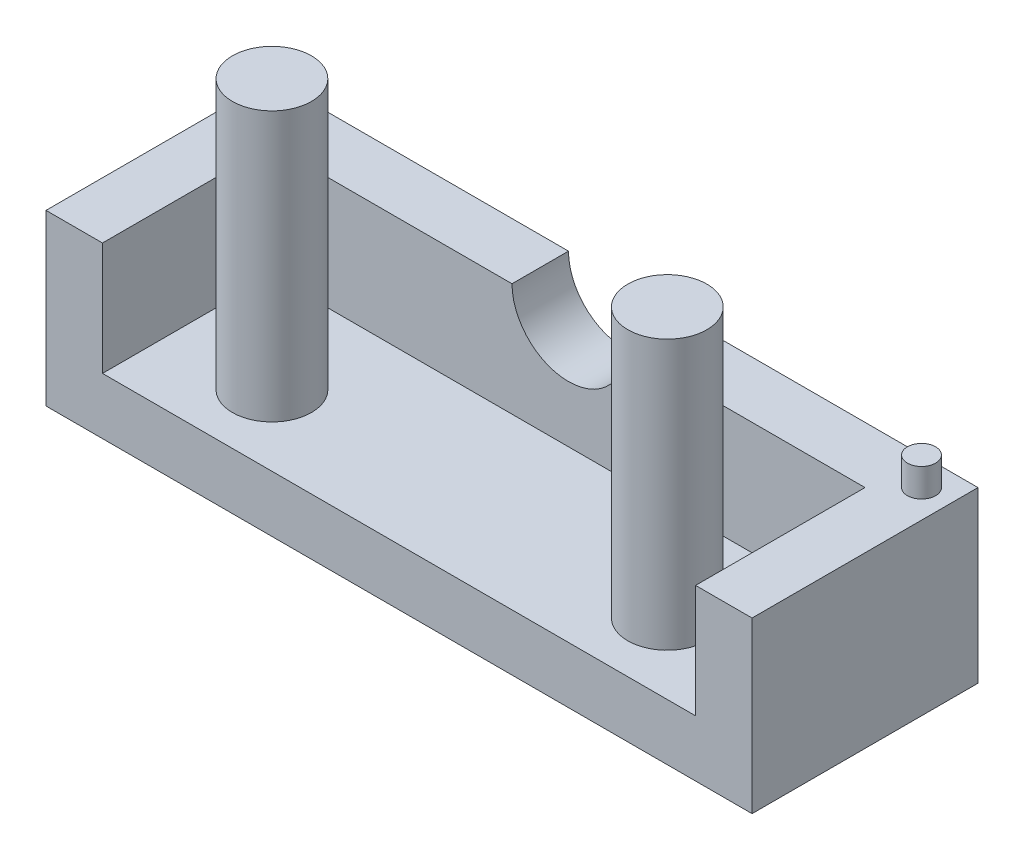
ISO-10303-21;
HEADER;
FILE_DESCRIPTION(('STEP AP214'),'2;1');
FILE_NAME('part.step','',(''),(''),'','','');
FILE_SCHEMA(('AUTOMOTIVE_DESIGN { 1 0 10303 214 1 1 1 1 }'));
ENDSEC;
DATA;
#1=APPLICATION_CONTEXT('core data for automotive mechanical design processes');
#2=APPLICATION_PROTOCOL_DEFINITION('international standard','automotive_design',2000,#1);
#3=PRODUCT_CONTEXT('',#1,'mechanical');
#4=PRODUCT('Part','Part','',(#3));
#5=PRODUCT_RELATED_PRODUCT_CATEGORY('part','',(#4));
#6=PRODUCT_DEFINITION_FORMATION('','',#4);
#7=PRODUCT_DEFINITION_CONTEXT('part definition',#1,'design');
#8=PRODUCT_DEFINITION('design','',#6,#7);
#9=PRODUCT_DEFINITION_SHAPE('','',#8);
#10=(LENGTH_UNIT() NAMED_UNIT(*) SI_UNIT(.MILLI.,.METRE.));
#11=(NAMED_UNIT(*) PLANE_ANGLE_UNIT() SI_UNIT($,.RADIAN.));
#12=(NAMED_UNIT(*) SI_UNIT($,.STERADIAN.) SOLID_ANGLE_UNIT());
#13=UNCERTAINTY_MEASURE_WITH_UNIT(LENGTH_MEASURE(1.E-05),#10,'distance_accuracy_value','');
#14=(GEOMETRIC_REPRESENTATION_CONTEXT(3) GLOBAL_UNCERTAINTY_ASSIGNED_CONTEXT((#13)) GLOBAL_UNIT_ASSIGNED_CONTEXT((#10,
#11,#12)) REPRESENTATION_CONTEXT('',''));
#15=CARTESIAN_POINT('',(0.,0.,0.));
#16=DIRECTION('',(0.,0.,1.));
#17=DIRECTION('',(1.,0.,0.));
#18=AXIS2_PLACEMENT_3D('',#15,#16,#17);
#19=CARTESIAN_POINT('',(-7.,3.04,-11.5));
#20=DIRECTION('',(0.,1.,0.));
#21=DIRECTION('',(0.,0.,1.));
#22=AXIS2_PLACEMENT_3D('',#19,#20,#21);
#23=CYLINDRICAL_SURFACE('',#22,1.4);
#24=CARTESIAN_POINT('',(-7.,3.04,-11.5));
#25=DIRECTION('',(0.,1.,0.));
#26=DIRECTION('',(0.,0.,1.));
#27=AXIS2_PLACEMENT_3D('',#24,#25,#26);
#28=CIRCLE('',#27,1.4);
#29=CARTESIAN_POINT('',(-7.,3.04,-10.1));
#30=VERTEX_POINT('',#29);
#31=EDGE_CURVE('E11',#30,#30,#28,.T.);
#32=ORIENTED_EDGE('',*,*,#31,.T.);
#33=EDGE_LOOP('',(#32));
#34=FACE_BOUND('',#33,.T.);
#35=CARTESIAN_POINT('',(-7.,12.58,-11.5));
#36=DIRECTION('',(0.,1.,0.));
#37=DIRECTION('',(0.,0.,1.));
#38=AXIS2_PLACEMENT_3D('',#35,#36,#37);
#39=CIRCLE('',#38,1.4);
#40=CARTESIAN_POINT('',(-7.,12.58,-10.1));
#41=VERTEX_POINT('',#40);
#42=EDGE_CURVE('E146',#41,#41,#39,.T.);
#43=ORIENTED_EDGE('',*,*,#42,.F.);
#44=EDGE_LOOP('',(#43));
#45=FACE_BOUND('',#44,.T.);
#46=ADVANCED_FACE('F45',(#34,#45),#23,.T.);
#47=CARTESIAN_POINT('',(7.,3.04,-11.5));
#48=DIRECTION('',(0.,1.,0.));
#49=DIRECTION('',(0.,0.,1.));
#50=AXIS2_PLACEMENT_3D('',#47,#48,#49);
#51=CYLINDRICAL_SURFACE('',#50,1.4);
#52=CARTESIAN_POINT('',(7.,3.04,-11.5));
#53=DIRECTION('',(0.,1.,0.));
#54=DIRECTION('',(0.,0.,1.));
#55=AXIS2_PLACEMENT_3D('',#52,#53,#54);
#56=CIRCLE('',#55,1.4);
#57=CARTESIAN_POINT('',(7.,3.04,-10.1));
#58=VERTEX_POINT('',#57);
#59=EDGE_CURVE('E172',#58,#58,#56,.T.);
#60=ORIENTED_EDGE('',*,*,#59,.T.);
#61=EDGE_LOOP('',(#60));
#62=FACE_BOUND('',#61,.T.);
#63=CARTESIAN_POINT('',(7.,12.58,-11.5));
#64=DIRECTION('',(0.,1.,0.));
#65=DIRECTION('',(0.,0.,1.));
#66=AXIS2_PLACEMENT_3D('',#63,#64,#65);
#67=CIRCLE('',#66,1.4);
#68=CARTESIAN_POINT('',(7.,12.58,-10.1));
#69=VERTEX_POINT('',#68);
#70=EDGE_CURVE('E258',#69,#69,#67,.T.);
#71=ORIENTED_EDGE('',*,*,#70,.F.);
#72=EDGE_LOOP('',(#71));
#73=FACE_BOUND('',#72,.T.);
#74=ADVANCED_FACE('F297',(#62,#73),#51,.T.);
#75=CARTESIAN_POINT('',(0.,3.04,0.));
#76=DIRECTION('',(0.,-1.,0.));
#77=DIRECTION('',(0.,0.,-1.));
#78=AXIS2_PLACEMENT_3D('',#75,#76,#77);
#79=PLANE('',#78);
#80=ORIENTED_EDGE('',*,*,#31,.F.);
#81=EDGE_LOOP('',(#80));
#82=FACE_BOUND('',#81,.T.);
#83=ORIENTED_EDGE('',*,*,#59,.F.);
#84=EDGE_LOOP('',(#83));
#85=FACE_BOUND('',#84,.T.);
#86=DIRECTION('',(0.,0.,-1.));
#87=VECTOR('',#86,1.);
#88=CARTESIAN_POINT('',(10.5,3.04,0.));
#89=LINE('',#88,#87);
#90=CARTESIAN_POINT('',(10.5,3.04,-9.));
#91=VERTEX_POINT('',#90);
#92=CARTESIAN_POINT('',(10.5,3.04,-15.));
#93=VERTEX_POINT('',#92);
#94=EDGE_CURVE('E160',#91,#93,#89,.T.);
#95=ORIENTED_EDGE('',*,*,#94,.T.);
#96=DIRECTION('',(1.,0.,0.));
#97=VECTOR('',#96,1.);
#98=CARTESIAN_POINT('',(0.,3.04,-15.));
#99=LINE('',#98,#97);
#100=CARTESIAN_POINT('',(-10.5,3.04,-15.));
#101=VERTEX_POINT('',#100);
#102=EDGE_CURVE('E224',#101,#93,#99,.T.);
#103=ORIENTED_EDGE('',*,*,#102,.F.);
#104=DIRECTION('',(0.,0.,1.));
#105=VECTOR('',#104,1.);
#106=CARTESIAN_POINT('',(-10.5,3.04,0.));
#107=LINE('',#106,#105);
#108=CARTESIAN_POINT('',(-10.5,3.04,-9.));
#109=VERTEX_POINT('',#108);
#110=EDGE_CURVE('E231',#101,#109,#107,.T.);
#111=ORIENTED_EDGE('',*,*,#110,.T.);
#112=DIRECTION('',(-1.,0.,0.));
#113=VECTOR('',#112,1.);
#114=CARTESIAN_POINT('',(-12.5,3.04,-9.));
#115=LINE('',#114,#113);
#116=EDGE_CURVE('E176',#91,#109,#115,.T.);
#117=ORIENTED_EDGE('',*,*,#116,.F.);
#118=EDGE_LOOP('',(#95,#103,#111,#117));
#119=FACE_BOUND('',#118,.T.);
#120=ADVANCED_FACE('F239',(#82,#85,#119),#79,.F.);
#121=CARTESIAN_POINT('',(-12.5,1.04,-9.));
#122=DIRECTION('',(1.,0.,0.));
#123=DIRECTION('',(0.,0.,-1.));
#124=AXIS2_PLACEMENT_3D('',#121,#122,#123);
#125=PLANE('',#124);
#126=DIRECTION('',(0.,1.,0.));
#127=VECTOR('',#126,1.);
#128=CARTESIAN_POINT('',(-12.5,1.04,-9.));
#129=LINE('',#128,#127);
#130=CARTESIAN_POINT('',(-12.5,1.04,-9.));
#131=VERTEX_POINT('',#130);
#132=CARTESIAN_POINT('',(-12.5,7.04,-9.));
#133=VERTEX_POINT('',#132);
#134=EDGE_CURVE('E188',#131,#133,#129,.T.);
#135=ORIENTED_EDGE('',*,*,#134,.T.);
#136=DIRECTION('',(0.,0.,1.));
#137=VECTOR('',#136,1.);
#138=CARTESIAN_POINT('',(-12.5,7.04,-17.));
#139=LINE('',#138,#137);
#140=CARTESIAN_POINT('',(-12.5,7.04,-17.));
#141=VERTEX_POINT('',#140);
#142=EDGE_CURVE('E153',#141,#133,#139,.T.);
#143=ORIENTED_EDGE('',*,*,#142,.F.);
#144=DIRECTION('',(0.,1.,0.));
#145=VECTOR('',#144,1.);
#146=CARTESIAN_POINT('',(-12.5,1.04,-17.));
#147=LINE('',#146,#145);
#148=CARTESIAN_POINT('',(-12.5,1.04,-17.));
#149=VERTEX_POINT('',#148);
#150=EDGE_CURVE('E53',#149,#141,#147,.T.);
#151=ORIENTED_EDGE('',*,*,#150,.F.);
#152=DIRECTION('',(0.,0.,-1.));
#153=VECTOR('',#152,1.);
#154=CARTESIAN_POINT('',(-12.5,1.04,-9.));
#155=LINE('',#154,#153);
#156=EDGE_CURVE('E177',#131,#149,#155,.T.);
#157=ORIENTED_EDGE('',*,*,#156,.F.);
#158=EDGE_LOOP('',(#135,#143,#151,#157));
#159=FACE_BOUND('',#158,.T.);
#160=ADVANCED_FACE('F207',(#159),#125,.F.);
#161=CARTESIAN_POINT('',(-12.5,1.04,-17.));
#162=DIRECTION('',(0.,0.,1.));
#163=DIRECTION('',(1.,0.,0.));
#164=AXIS2_PLACEMENT_3D('',#161,#162,#163);
#165=PLANE('',#164);
#166=ORIENTED_EDGE('',*,*,#150,.T.);
#167=DIRECTION('',(-1.,0.,0.));
#168=VECTOR('',#167,1.);
#169=CARTESIAN_POINT('',(12.5,7.04,-17.));
#170=LINE('',#169,#168);
#171=CARTESIAN_POINT('',(-2.,7.04,-17.));
#172=VERTEX_POINT('',#171);
#173=EDGE_CURVE('E144',#172,#141,#170,.T.);
#174=ORIENTED_EDGE('',*,*,#173,.F.);
#175=CARTESIAN_POINT('',(0.,7.04,-17.));
#176=DIRECTION('',(0.,0.,1.));
#177=DIRECTION('',(1.,0.,0.));
#178=AXIS2_PLACEMENT_3D('',#175,#176,#177);
#179=CIRCLE('',#178,2.);
#180=CARTESIAN_POINT('',(2.,7.04,-17.));
#181=VERTEX_POINT('',#180);
#182=EDGE_CURVE('E125',#172,#181,#179,.T.);
#183=ORIENTED_EDGE('',*,*,#182,.T.);
#184=CARTESIAN_POINT('',(12.5,7.04,-17.));
#185=VERTEX_POINT('',#184);
#186=EDGE_CURVE('E141',#185,#181,#170,.T.);
#187=ORIENTED_EDGE('',*,*,#186,.F.);
#188=DIRECTION('',(0.,1.,0.));
#189=VECTOR('',#188,1.);
#190=CARTESIAN_POINT('',(12.5,1.04,-17.));
#191=LINE('',#190,#189);
#192=CARTESIAN_POINT('',(12.5,1.04,-17.));
#193=VERTEX_POINT('',#192);
#194=EDGE_CURVE('E197',#193,#185,#191,.T.);
#195=ORIENTED_EDGE('',*,*,#194,.F.);
#196=DIRECTION('',(1.,0.,0.));
#197=VECTOR('',#196,1.);
#198=CARTESIAN_POINT('',(-12.5,1.04,-17.));
#199=LINE('',#198,#197);
#200=EDGE_CURVE('E180',#149,#193,#199,.T.);
#201=ORIENTED_EDGE('',*,*,#200,.F.);
#202=EDGE_LOOP('',(#166,#174,#183,#187,#195,#201));
#203=FACE_BOUND('',#202,.T.);
#204=ADVANCED_FACE('F139',(#203),#165,.F.);
#205=CARTESIAN_POINT('',(12.5,1.04,-9.));
#206=DIRECTION('',(-1.,0.,0.));
#207=DIRECTION('',(0.,0.,1.));
#208=AXIS2_PLACEMENT_3D('',#205,#206,#207);
#209=PLANE('',#208);
#210=ORIENTED_EDGE('',*,*,#194,.T.);
#211=DIRECTION('',(0.,0.,-1.));
#212=VECTOR('',#211,1.);
#213=CARTESIAN_POINT('',(12.5,7.04,-9.));
#214=LINE('',#213,#212);
#215=CARTESIAN_POINT('',(12.5,7.04,-9.));
#216=VERTEX_POINT('',#215);
#217=EDGE_CURVE('E151',#216,#185,#214,.T.);
#218=ORIENTED_EDGE('',*,*,#217,.F.);
#219=DIRECTION('',(0.,1.,0.));
#220=VECTOR('',#219,1.);
#221=CARTESIAN_POINT('',(12.5,1.04,-9.));
#222=LINE('',#221,#220);
#223=CARTESIAN_POINT('',(12.5,1.04,-9.));
#224=VERTEX_POINT('',#223);
#225=EDGE_CURVE('E194',#224,#216,#222,.T.);
#226=ORIENTED_EDGE('',*,*,#225,.F.);
#227=DIRECTION('',(0.,0.,1.));
#228=VECTOR('',#227,1.);
#229=CARTESIAN_POINT('',(12.5,1.04,-9.));
#230=LINE('',#229,#228);
#231=EDGE_CURVE('E183',#193,#224,#230,.T.);
#232=ORIENTED_EDGE('',*,*,#231,.F.);
#233=EDGE_LOOP('',(#210,#218,#226,#232));
#234=FACE_BOUND('',#233,.T.);
#235=ADVANCED_FACE('F465',(#234),#209,.F.);
#236=CARTESIAN_POINT('',(-12.5,1.04,-9.));
#237=DIRECTION('',(0.,0.,-1.));
#238=DIRECTION('',(-1.,0.,0.));
#239=AXIS2_PLACEMENT_3D('',#236,#237,#238);
#240=PLANE('',#239);
#241=ORIENTED_EDGE('',*,*,#225,.T.);
#242=DIRECTION('',(1.,0.,0.));
#243=VECTOR('',#242,1.);
#244=CARTESIAN_POINT('',(-12.5,7.04,-9.));
#245=LINE('',#244,#243);
#246=CARTESIAN_POINT('',(10.5,7.04,-9.));
#247=VERTEX_POINT('',#246);
#248=EDGE_CURVE('E158',#247,#216,#245,.T.);
#249=ORIENTED_EDGE('',*,*,#248,.F.);
#250=DIRECTION('',(0.,1.,0.));
#251=VECTOR('',#250,1.);
#252=CARTESIAN_POINT('',(10.5,2.,-9.));
#253=LINE('',#252,#251);
#254=EDGE_CURVE('E244',#91,#247,#253,.T.);
#255=ORIENTED_EDGE('',*,*,#254,.F.);
#256=ORIENTED_EDGE('',*,*,#116,.T.);
#257=DIRECTION('',(0.,-1.,0.));
#258=VECTOR('',#257,1.);
#259=CARTESIAN_POINT('',(-10.5,7.04,-9.));
#260=LINE('',#259,#258);
#261=CARTESIAN_POINT('',(-10.5,7.04,-9.));
#262=VERTEX_POINT('',#261);
#263=EDGE_CURVE('E212',#262,#109,#260,.T.);
#264=ORIENTED_EDGE('',*,*,#263,.F.);
#265=EDGE_CURVE('E164',#133,#262,#245,.T.);
#266=ORIENTED_EDGE('',*,*,#265,.F.);
#267=ORIENTED_EDGE('',*,*,#134,.F.);
#268=DIRECTION('',(-1.,0.,0.));
#269=VECTOR('',#268,1.);
#270=CARTESIAN_POINT('',(-12.5,1.04,-9.));
#271=LINE('',#270,#269);
#272=EDGE_CURVE('E68',#224,#131,#271,.T.);
#273=ORIENTED_EDGE('',*,*,#272,.F.);
#274=EDGE_LOOP('',(#241,#249,#255,#256,#264,#266,#267,#273));
#275=FACE_BOUND('',#274,.T.);
#276=ADVANCED_FACE('F211',(#275),#240,.F.);
#277=CARTESIAN_POINT('',(0.,1.04,0.));
#278=DIRECTION('',(0.,-1.,0.));
#279=DIRECTION('',(0.,0.,-1.));
#280=AXIS2_PLACEMENT_3D('',#277,#278,#279);
#281=PLANE('',#280);
#282=ORIENTED_EDGE('',*,*,#156,.T.);
#283=ORIENTED_EDGE('',*,*,#200,.T.);
#284=ORIENTED_EDGE('',*,*,#231,.T.);
#285=ORIENTED_EDGE('',*,*,#272,.T.);
#286=EDGE_LOOP('',(#282,#283,#284,#285));
#287=FACE_BOUND('',#286,.T.);
#288=ADVANCED_FACE('F285',(#287),#281,.T.);
#289=CARTESIAN_POINT('',(0.,7.04,0.));
#290=DIRECTION('',(0.,1.,0.));
#291=DIRECTION('',(0.,0.,1.));
#292=AXIS2_PLACEMENT_3D('',#289,#290,#291);
#293=PLANE('',#292);
#294=CARTESIAN_POINT('',(-11.5,7.04,-16.));
#295=DIRECTION('',(0.,1.,0.));
#296=DIRECTION('',(0.,0.,1.));
#297=AXIS2_PLACEMENT_3D('',#294,#295,#296);
#298=CIRCLE('',#297,0.500000000000001);
#299=CARTESIAN_POINT('',(-11.5,7.04,-15.5));
#300=VERTEX_POINT('',#299);
#301=EDGE_CURVE('E270',#300,#300,#298,.T.);
#302=ORIENTED_EDGE('',*,*,#301,.F.);
#303=EDGE_LOOP('',(#302));
#304=FACE_BOUND('',#303,.T.);
#305=DIRECTION('',(0.,0.,1.));
#306=VECTOR('',#305,1.);
#307=CARTESIAN_POINT('',(-2.,7.04,-15.));
#308=LINE('',#307,#306);
#309=CARTESIAN_POINT('',(-2.,7.04,-15.));
#310=VERTEX_POINT('',#309);
#311=EDGE_CURVE('E134',#172,#310,#308,.T.);
#312=ORIENTED_EDGE('',*,*,#311,.F.);
#313=ORIENTED_EDGE('',*,*,#173,.T.);
#314=ORIENTED_EDGE('',*,*,#142,.T.);
#315=ORIENTED_EDGE('',*,*,#265,.T.);
#316=DIRECTION('',(0.,0.,1.));
#317=VECTOR('',#316,1.);
#318=CARTESIAN_POINT('',(-10.5,7.04,-15.));
#319=LINE('',#318,#317);
#320=CARTESIAN_POINT('',(-10.5,7.04,-15.));
#321=VERTEX_POINT('',#320);
#322=EDGE_CURVE('E214',#321,#262,#319,.T.);
#323=ORIENTED_EDGE('',*,*,#322,.F.);
#324=DIRECTION('',(-1.,0.,0.));
#325=VECTOR('',#324,1.);
#326=CARTESIAN_POINT('',(10.5,7.04,-15.));
#327=LINE('',#326,#325);
#328=EDGE_CURVE('E215',#310,#321,#327,.T.);
#329=ORIENTED_EDGE('',*,*,#328,.F.);
#330=EDGE_LOOP('',(#312,#313,#314,#315,#323,#329));
#331=FACE_BOUND('',#330,.T.);
#332=ADVANCED_FACE('F205',(#304,#331),#293,.T.);
#333=CARTESIAN_POINT('',(11.5,7.04,-16.));
#334=DIRECTION('',(0.,1.,0.));
#335=DIRECTION('',(0.,0.,1.));
#336=AXIS2_PLACEMENT_3D('',#333,#334,#335);
#337=CIRCLE('',#336,0.500000000000001);
#338=CARTESIAN_POINT('',(11.5,7.04,-15.5));
#339=VERTEX_POINT('',#338);
#340=EDGE_CURVE('E266',#339,#339,#337,.T.);
#341=ORIENTED_EDGE('',*,*,#340,.F.);
#342=EDGE_LOOP('',(#341));
#343=FACE_BOUND('',#342,.T.);
#344=DIRECTION('',(0.,0.,1.));
#345=VECTOR('',#344,1.);
#346=CARTESIAN_POINT('',(2.,7.04,-15.));
#347=LINE('',#346,#345);
#348=CARTESIAN_POINT('',(2.,7.04,-15.));
#349=VERTEX_POINT('',#348);
#350=EDGE_CURVE('E122',#349,#181,#347,.F.);
#351=ORIENTED_EDGE('',*,*,#350,.F.);
#352=CARTESIAN_POINT('',(10.5,7.04,-15.));
#353=VERTEX_POINT('',#352);
#354=EDGE_CURVE('E249',#353,#349,#327,.T.);
#355=ORIENTED_EDGE('',*,*,#354,.F.);
#356=DIRECTION('',(0.,0.,1.));
#357=VECTOR('',#356,1.);
#358=CARTESIAN_POINT('',(10.5,7.04,-15.));
#359=LINE('',#358,#357);
#360=EDGE_CURVE('E218',#353,#247,#359,.T.);
#361=ORIENTED_EDGE('',*,*,#360,.T.);
#362=ORIENTED_EDGE('',*,*,#248,.T.);
#363=ORIENTED_EDGE('',*,*,#217,.T.);
#364=ORIENTED_EDGE('',*,*,#186,.T.);
#365=EDGE_LOOP('',(#351,#355,#361,#362,#363,#364));
#366=FACE_BOUND('',#365,.T.);
#367=ADVANCED_FACE('F148',(#343,#366),#293,.T.);
#368=CARTESIAN_POINT('',(10.5,2.,-15.));
#369=DIRECTION('',(1.,0.,0.));
#370=DIRECTION('',(0.,0.,-1.));
#371=AXIS2_PLACEMENT_3D('',#368,#369,#370);
#372=PLANE('',#371);
#373=ORIENTED_EDGE('',*,*,#254,.T.);
#374=ORIENTED_EDGE('',*,*,#360,.F.);
#375=DIRECTION('',(0.,1.,0.));
#376=VECTOR('',#375,1.);
#377=CARTESIAN_POINT('',(10.5,2.,-15.));
#378=LINE('',#377,#376);
#379=EDGE_CURVE('E219',#93,#353,#378,.T.);
#380=ORIENTED_EDGE('',*,*,#379,.F.);
#381=ORIENTED_EDGE('',*,*,#94,.F.);
#382=EDGE_LOOP('',(#373,#374,#380,#381));
#383=FACE_BOUND('',#382,.T.);
#384=ADVANCED_FACE('F243',(#383),#372,.F.);
#385=CARTESIAN_POINT('',(-10.5,7.04,-15.));
#386=DIRECTION('',(-1.,0.,0.));
#387=DIRECTION('',(0.,0.,1.));
#388=AXIS2_PLACEMENT_3D('',#385,#386,#387);
#389=PLANE('',#388);
#390=DIRECTION('',(0.,-1.,0.));
#391=VECTOR('',#390,1.);
#392=CARTESIAN_POINT('',(-10.5,7.04,-15.));
#393=LINE('',#392,#391);
#394=EDGE_CURVE('E60',#321,#101,#393,.T.);
#395=ORIENTED_EDGE('',*,*,#394,.F.);
#396=ORIENTED_EDGE('',*,*,#322,.T.);
#397=ORIENTED_EDGE('',*,*,#263,.T.);
#398=ORIENTED_EDGE('',*,*,#110,.F.);
#399=EDGE_LOOP('',(#395,#396,#397,#398));
#400=FACE_BOUND('',#399,.T.);
#401=ADVANCED_FACE('F328',(#400),#389,.F.);
#402=CARTESIAN_POINT('',(0.,0.,-15.));
#403=DIRECTION('',(0.,0.,1.));
#404=DIRECTION('',(1.,0.,0.));
#405=AXIS2_PLACEMENT_3D('',#402,#403,#404);
#406=PLANE('',#405);
#407=CARTESIAN_POINT('',(0.,7.04,-15.));
#408=DIRECTION('',(0.,0.,1.));
#409=DIRECTION('',(1.,0.,0.));
#410=AXIS2_PLACEMENT_3D('',#407,#408,#409);
#411=CIRCLE('',#410,2.);
#412=EDGE_CURVE('E128',#310,#349,#411,.T.);
#413=ORIENTED_EDGE('',*,*,#412,.F.);
#414=ORIENTED_EDGE('',*,*,#328,.T.);
#415=ORIENTED_EDGE('',*,*,#394,.T.);
#416=ORIENTED_EDGE('',*,*,#102,.T.);
#417=ORIENTED_EDGE('',*,*,#379,.T.);
#418=ORIENTED_EDGE('',*,*,#354,.T.);
#419=EDGE_LOOP('',(#413,#414,#415,#416,#417,#418));
#420=FACE_BOUND('',#419,.T.);
#421=ADVANCED_FACE('F325',(#420),#406,.T.);
#422=CARTESIAN_POINT('',(0.,7.04,-15.));
#423=DIRECTION('',(0.,0.,1.));
#424=DIRECTION('',(1.,0.,0.));
#425=AXIS2_PLACEMENT_3D('',#422,#423,#424);
#426=CYLINDRICAL_SURFACE('',#425,2.);
#427=ORIENTED_EDGE('',*,*,#311,.T.);
#428=ORIENTED_EDGE('',*,*,#412,.T.);
#429=ORIENTED_EDGE('',*,*,#350,.T.);
#430=ORIENTED_EDGE('',*,*,#182,.F.);
#431=EDGE_LOOP('',(#427,#428,#429,#430));
#432=FACE_BOUND('',#431,.T.);
#433=ADVANCED_FACE('F124',(#432),#426,.F.);
#434=CARTESIAN_POINT('',(7.,12.58,-11.5));
#435=DIRECTION('',(0.,1.,0.));
#436=DIRECTION('',(0.,0.,1.));
#437=AXIS2_PLACEMENT_3D('',#434,#435,#436);
#438=PLANE('',#437);
#439=ORIENTED_EDGE('',*,*,#70,.T.);
#440=EDGE_LOOP('',(#439));
#441=FACE_BOUND('',#440,.T.);
#442=ADVANCED_FACE('F311',(#441),#438,.T.);
#443=CARTESIAN_POINT('',(-7.,12.58,-11.5));
#444=DIRECTION('',(0.,1.,0.));
#445=DIRECTION('',(0.,0.,1.));
#446=AXIS2_PLACEMENT_3D('',#443,#444,#445);
#447=PLANE('',#446);
#448=ORIENTED_EDGE('',*,*,#42,.T.);
#449=EDGE_LOOP('',(#448));
#450=FACE_BOUND('',#449,.T.);
#451=ADVANCED_FACE('F308',(#450),#447,.T.);
#452=CARTESIAN_POINT('',(11.5,8.04,-16.));
#453=DIRECTION('',(0.,-1.,0.));
#454=DIRECTION('',(0.,0.,-1.));
#455=AXIS2_PLACEMENT_3D('',#452,#453,#454);
#456=CYLINDRICAL_SURFACE('',#455,0.500000000000001);
#457=CARTESIAN_POINT('',(11.5,8.04,-16.));
#458=DIRECTION('',(0.,1.,0.));
#459=DIRECTION('',(0.,0.,1.));
#460=AXIS2_PLACEMENT_3D('',#457,#458,#459);
#461=CIRCLE('',#460,0.500000000000001);
#462=CARTESIAN_POINT('',(11.5,8.04,-15.5));
#463=VERTEX_POINT('',#462);
#464=EDGE_CURVE('E262',#463,#463,#461,.T.);
#465=ORIENTED_EDGE('',*,*,#464,.F.);
#466=EDGE_LOOP('',(#465));
#467=FACE_BOUND('',#466,.T.);
#468=ORIENTED_EDGE('',*,*,#340,.T.);
#469=EDGE_LOOP('',(#468));
#470=FACE_BOUND('',#469,.T.);
#471=ADVANCED_FACE('F310',(#467,#470),#456,.T.);
#472=CARTESIAN_POINT('',(11.5,8.04,-16.));
#473=DIRECTION('',(0.,1.,0.));
#474=DIRECTION('',(0.,0.,1.));
#475=AXIS2_PLACEMENT_3D('',#472,#473,#474);
#476=PLANE('',#475);
#477=ORIENTED_EDGE('',*,*,#464,.T.);
#478=EDGE_LOOP('',(#477));
#479=FACE_BOUND('',#478,.T.);
#480=ADVANCED_FACE('F317',(#479),#476,.T.);
#481=CARTESIAN_POINT('',(-11.5,8.04,-16.));
#482=DIRECTION('',(0.,-1.,0.));
#483=DIRECTION('',(0.,0.,-1.));
#484=AXIS2_PLACEMENT_3D('',#481,#482,#483);
#485=CYLINDRICAL_SURFACE('',#484,0.500000000000001);
#486=CARTESIAN_POINT('',(-11.5,8.04,-16.));
#487=DIRECTION('',(0.,1.,0.));
#488=DIRECTION('',(0.,0.,1.));
#489=AXIS2_PLACEMENT_3D('',#486,#487,#488);
#490=CIRCLE('',#489,0.500000000000001);
#491=CARTESIAN_POINT('',(-11.5,8.04,-15.5));
#492=VERTEX_POINT('',#491);
#493=EDGE_CURVE('E274',#492,#492,#490,.T.);
#494=ORIENTED_EDGE('',*,*,#493,.F.);
#495=EDGE_LOOP('',(#494));
#496=FACE_BOUND('',#495,.T.);
#497=ORIENTED_EDGE('',*,*,#301,.T.);
#498=EDGE_LOOP('',(#497));
#499=FACE_BOUND('',#498,.T.);
#500=ADVANCED_FACE('F282',(#496,#499),#485,.T.);
#501=CARTESIAN_POINT('',(-11.5,8.04,-16.));
#502=DIRECTION('',(0.,1.,0.));
#503=DIRECTION('',(0.,0.,1.));
#504=AXIS2_PLACEMENT_3D('',#501,#502,#503);
#505=PLANE('',#504);
#506=ORIENTED_EDGE('',*,*,#493,.T.);
#507=EDGE_LOOP('',(#506));
#508=FACE_BOUND('',#507,.T.);
#509=ADVANCED_FACE('F414',(#508),#505,.T.);
#510=CLOSED_SHELL('',(#46,#74,#120,#160,#204,#235,#276,#288,#332,#367,#384,#401,#421,#433,#442,
#451,#471,#480,#500,#509));
#511=MANIFOLD_SOLID_BREP('B2',#510);
#512=ADVANCED_BREP_SHAPE_REPRESENTATION('',(#18,#511),#14);
#513=SHAPE_DEFINITION_REPRESENTATION(#9,#512);
ENDSEC;
END-ISO-10303-21;
